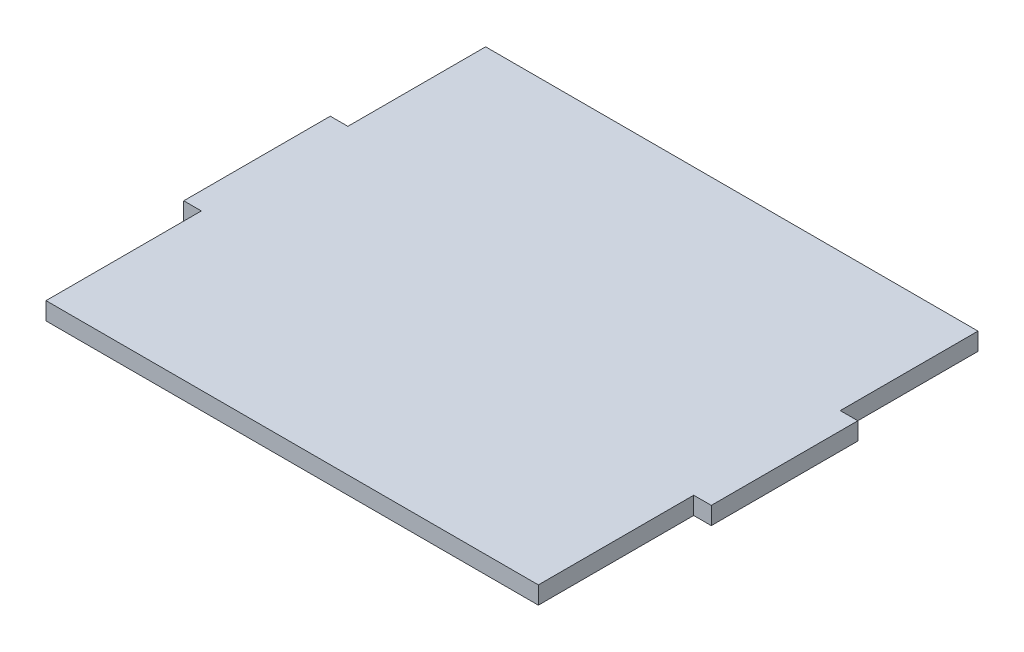
ISO-10303-21;
HEADER;
FILE_DESCRIPTION(('STEP AP214'),'2;1');
FILE_NAME('part.step','',(''),(''),'','','');
FILE_SCHEMA(('AUTOMOTIVE_DESIGN { 1 0 10303 214 1 1 1 1 }'));
ENDSEC;
DATA;
#1=APPLICATION_CONTEXT('core data for automotive mechanical design processes');
#2=APPLICATION_PROTOCOL_DEFINITION('international standard','automotive_design',2000,#1);
#3=PRODUCT_CONTEXT('',#1,'mechanical');
#4=PRODUCT('Part','Part','',(#3));
#5=PRODUCT_RELATED_PRODUCT_CATEGORY('part','',(#4));
#6=PRODUCT_DEFINITION_FORMATION('','',#4);
#7=PRODUCT_DEFINITION_CONTEXT('part definition',#1,'design');
#8=PRODUCT_DEFINITION('design','',#6,#7);
#9=PRODUCT_DEFINITION_SHAPE('','',#8);
#10=(LENGTH_UNIT() NAMED_UNIT(*) SI_UNIT(.MILLI.,.METRE.));
#11=(NAMED_UNIT(*) PLANE_ANGLE_UNIT() SI_UNIT($,.RADIAN.));
#12=(NAMED_UNIT(*) SI_UNIT($,.STERADIAN.) SOLID_ANGLE_UNIT());
#13=UNCERTAINTY_MEASURE_WITH_UNIT(LENGTH_MEASURE(1.E-05),#10,'distance_accuracy_value','');
#14=(GEOMETRIC_REPRESENTATION_CONTEXT(3) GLOBAL_UNCERTAINTY_ASSIGNED_CONTEXT((#13)) GLOBAL_UNIT_ASSIGNED_CONTEXT((#10,
#11,#12)) REPRESENTATION_CONTEXT('',''));
#15=CARTESIAN_POINT('',(0.,0.,0.));
#16=DIRECTION('',(0.,0.,1.));
#17=DIRECTION('',(1.,0.,0.));
#18=AXIS2_PLACEMENT_3D('',#15,#16,#17);
#19=CARTESIAN_POINT('',(0.,2.54,0.));
#20=DIRECTION('',(0.,0.,-1.));
#21=DIRECTION('',(-1.,0.,0.));
#22=AXIS2_PLACEMENT_3D('',#19,#20,#21);
#23=PLANE('',#22);
#24=DIRECTION('',(1.,0.,0.));
#25=VECTOR('',#24,1.);
#26=CARTESIAN_POINT('',(0.,2.54,0.));
#27=LINE('',#26,#25);
#28=CARTESIAN_POINT('',(2.54,2.54,0.));
#29=VERTEX_POINT('',#28);
#30=CARTESIAN_POINT('',(73.66,2.54,0.));
#31=VERTEX_POINT('',#30);
#32=EDGE_CURVE('E141',#29,#31,#27,.T.);
#33=ORIENTED_EDGE('',*,*,#32,.F.);
#34=DIRECTION('',(0.,1.,0.));
#35=VECTOR('',#34,1.);
#36=CARTESIAN_POINT('',(2.54,0.,0.));
#37=LINE('',#36,#35);
#38=CARTESIAN_POINT('',(2.54,0.,0.));
#39=VERTEX_POINT('',#38);
#40=EDGE_CURVE('E127',#39,#29,#37,.T.);
#41=ORIENTED_EDGE('',*,*,#40,.F.);
#42=DIRECTION('',(1.,0.,0.));
#43=VECTOR('',#42,1.);
#44=CARTESIAN_POINT('',(0.,0.,0.));
#45=LINE('',#44,#43);
#46=CARTESIAN_POINT('',(73.66,0.,0.));
#47=VERTEX_POINT('',#46);
#48=EDGE_CURVE('E139',#39,#47,#45,.T.);
#49=ORIENTED_EDGE('',*,*,#48,.T.);
#50=DIRECTION('',(0.,1.,0.));
#51=VECTOR('',#50,1.);
#52=CARTESIAN_POINT('',(73.66,0.,0.));
#53=LINE('',#52,#51);
#54=EDGE_CURVE('E227',#47,#31,#53,.T.);
#55=ORIENTED_EDGE('',*,*,#54,.T.);
#56=EDGE_LOOP('',(#33,#41,#49,#55));
#57=FACE_BOUND('',#56,.T.);
#58=ADVANCED_FACE('F37',(#57),#23,.F.);
#59=CARTESIAN_POINT('',(76.2,2.54,0.));
#60=DIRECTION('',(-1.,0.,0.));
#61=DIRECTION('',(0.,0.,1.));
#62=AXIS2_PLACEMENT_3D('',#59,#60,#61);
#63=PLANE('',#62);
#64=DIRECTION('',(0.,0.,-1.));
#65=VECTOR('',#64,1.);
#66=CARTESIAN_POINT('',(76.2,2.54,0.));
#67=LINE('',#66,#65);
#68=CARTESIAN_POINT('',(76.2,2.54,-22.4366582));
#69=VERTEX_POINT('',#68);
#70=CARTESIAN_POINT('',(76.2,2.54,-43.6033418));
#71=VERTEX_POINT('',#70);
#72=EDGE_CURVE('E164',#69,#71,#67,.T.);
#73=ORIENTED_EDGE('',*,*,#72,.F.);
#74=DIRECTION('',(0.,1.,0.));
#75=VECTOR('',#74,1.);
#76=CARTESIAN_POINT('',(76.2,0.,-22.4366582));
#77=LINE('',#76,#75);
#78=CARTESIAN_POINT('',(76.2,0.,-22.4366582));
#79=VERTEX_POINT('',#78);
#80=EDGE_CURVE('E191',#79,#69,#77,.T.);
#81=ORIENTED_EDGE('',*,*,#80,.F.);
#82=DIRECTION('',(0.,0.,-1.));
#83=VECTOR('',#82,1.);
#84=CARTESIAN_POINT('',(76.2,0.,0.));
#85=LINE('',#84,#83);
#86=CARTESIAN_POINT('',(76.2,0.,-43.6033418));
#87=VERTEX_POINT('',#86);
#88=EDGE_CURVE('E147',#79,#87,#85,.T.);
#89=ORIENTED_EDGE('',*,*,#88,.T.);
#90=DIRECTION('',(0.,1.,0.));
#91=VECTOR('',#90,1.);
#92=CARTESIAN_POINT('',(76.2,0.,-43.6033418));
#93=LINE('',#92,#91);
#94=EDGE_CURVE('E196',#87,#71,#93,.T.);
#95=ORIENTED_EDGE('',*,*,#94,.T.);
#96=EDGE_LOOP('',(#73,#81,#89,#95));
#97=FACE_BOUND('',#96,.T.);
#98=ADVANCED_FACE('F241',(#97),#63,.F.);
#99=CARTESIAN_POINT('',(0.,2.54,0.));
#100=DIRECTION('',(-1.,0.,0.));
#101=DIRECTION('',(0.,0.,1.));
#102=AXIS2_PLACEMENT_3D('',#99,#100,#101);
#103=PLANE('',#102);
#104=DIRECTION('',(0.,0.,-1.));
#105=VECTOR('',#104,1.);
#106=CARTESIAN_POINT('',(0.,0.,0.));
#107=LINE('',#106,#105);
#108=CARTESIAN_POINT('',(0.,0.,-22.4366582));
#109=VERTEX_POINT('',#108);
#110=CARTESIAN_POINT('',(0.,0.,-43.6033418));
#111=VERTEX_POINT('',#110);
#112=EDGE_CURVE('E40',#109,#111,#107,.T.);
#113=ORIENTED_EDGE('',*,*,#112,.F.);
#114=DIRECTION('',(0.,1.,0.));
#115=VECTOR('',#114,1.);
#116=CARTESIAN_POINT('',(0.,0.,-22.4366582));
#117=LINE('',#116,#115);
#118=CARTESIAN_POINT('',(0.,2.54,-22.4366582));
#119=VERTEX_POINT('',#118);
#120=EDGE_CURVE('E132',#109,#119,#117,.T.);
#121=ORIENTED_EDGE('',*,*,#120,.T.);
#122=DIRECTION('',(0.,0.,-1.));
#123=VECTOR('',#122,1.);
#124=CARTESIAN_POINT('',(0.,2.54,0.));
#125=LINE('',#124,#123);
#126=CARTESIAN_POINT('',(0.,2.54,-43.6033418));
#127=VERTEX_POINT('',#126);
#128=EDGE_CURVE('E11',#119,#127,#125,.T.);
#129=ORIENTED_EDGE('',*,*,#128,.T.);
#130=DIRECTION('',(0.,1.,0.));
#131=VECTOR('',#130,1.);
#132=CARTESIAN_POINT('',(0.,0.,-43.6033418));
#133=LINE('',#132,#131);
#134=EDGE_CURVE('E148',#111,#127,#133,.T.);
#135=ORIENTED_EDGE('',*,*,#134,.F.);
#136=EDGE_LOOP('',(#113,#121,#129,#135));
#137=FACE_BOUND('',#136,.T.);
#138=ADVANCED_FACE('F217',(#137),#103,.T.);
#139=CARTESIAN_POINT('',(0.,2.54,0.));
#140=DIRECTION('',(0.,1.,0.));
#141=DIRECTION('',(0.,0.,1.));
#142=AXIS2_PLACEMENT_3D('',#139,#140,#141);
#143=PLANE('',#142);
#144=ORIENTED_EDGE('',*,*,#128,.F.);
#145=DIRECTION('',(1.,0.,0.));
#146=VECTOR('',#145,1.);
#147=CARTESIAN_POINT('',(0.,2.54,-22.4366582));
#148=LINE('',#147,#146);
#149=CARTESIAN_POINT('',(2.54,2.54,-22.4366582));
#150=VERTEX_POINT('',#149);
#151=EDGE_CURVE('E214',#119,#150,#148,.T.);
#152=ORIENTED_EDGE('',*,*,#151,.T.);
#153=DIRECTION('',(0.,0.,-1.));
#154=VECTOR('',#153,1.);
#155=CARTESIAN_POINT('',(2.54,2.54,0.));
#156=LINE('',#155,#154);
#157=EDGE_CURVE('E221',#29,#150,#156,.T.);
#158=ORIENTED_EDGE('',*,*,#157,.F.);
#159=ORIENTED_EDGE('',*,*,#32,.T.);
#160=DIRECTION('',(0.,0.,-1.));
#161=VECTOR('',#160,1.);
#162=CARTESIAN_POINT('',(73.66,2.54,0.));
#163=LINE('',#162,#161);
#164=CARTESIAN_POINT('',(73.66,2.54,-22.4366582));
#165=VERTEX_POINT('',#164);
#166=EDGE_CURVE('E230',#31,#165,#163,.T.);
#167=ORIENTED_EDGE('',*,*,#166,.T.);
#168=DIRECTION('',(-1.,0.,0.));
#169=VECTOR('',#168,1.);
#170=CARTESIAN_POINT('',(76.2,2.54,-22.4366582));
#171=LINE('',#170,#169);
#172=EDGE_CURVE('E232',#69,#165,#171,.T.);
#173=ORIENTED_EDGE('',*,*,#172,.F.);
#174=ORIENTED_EDGE('',*,*,#72,.T.);
#175=DIRECTION('',(-1.,0.,0.));
#176=VECTOR('',#175,1.);
#177=CARTESIAN_POINT('',(76.2,2.54,-43.6033418));
#178=LINE('',#177,#176);
#179=CARTESIAN_POINT('',(73.66,2.54,-43.6033418));
#180=VERTEX_POINT('',#179);
#181=EDGE_CURVE('E188',#71,#180,#178,.T.);
#182=ORIENTED_EDGE('',*,*,#181,.T.);
#183=DIRECTION('',(0.,0.,1.));
#184=VECTOR('',#183,1.);
#185=CARTESIAN_POINT('',(73.66,2.54,-63.5));
#186=LINE('',#185,#184);
#187=CARTESIAN_POINT('',(73.66,2.54,-63.5));
#188=VERTEX_POINT('',#187);
#189=EDGE_CURVE('E187',#188,#180,#186,.T.);
#190=ORIENTED_EDGE('',*,*,#189,.F.);
#191=DIRECTION('',(1.,0.,0.));
#192=VECTOR('',#191,1.);
#193=CARTESIAN_POINT('',(0.,2.54,-63.5));
#194=LINE('',#193,#192);
#195=CARTESIAN_POINT('',(2.54,2.54,-63.5));
#196=VERTEX_POINT('',#195);
#197=EDGE_CURVE('E45',#196,#188,#194,.T.);
#198=ORIENTED_EDGE('',*,*,#197,.F.);
#199=DIRECTION('',(0.,0.,1.));
#200=VECTOR('',#199,1.);
#201=CARTESIAN_POINT('',(2.54,2.54,-63.5));
#202=LINE('',#201,#200);
#203=CARTESIAN_POINT('',(2.54,2.54,-43.6033418));
#204=VERTEX_POINT('',#203);
#205=EDGE_CURVE('E185',#196,#204,#202,.T.);
#206=ORIENTED_EDGE('',*,*,#205,.T.);
#207=DIRECTION('',(1.,0.,0.));
#208=VECTOR('',#207,1.);
#209=CARTESIAN_POINT('',(0.,2.54,-43.6033418));
#210=LINE('',#209,#208);
#211=EDGE_CURVE('E204',#127,#204,#210,.T.);
#212=ORIENTED_EDGE('',*,*,#211,.F.);
#213=EDGE_LOOP('',(#144,#152,#158,#159,#167,#173,#174,#182,#190,#198,#206,#212));
#214=FACE_BOUND('',#213,.T.);
#215=ADVANCED_FACE('F183',(#214),#143,.T.);
#216=CARTESIAN_POINT('',(0.,0.,0.));
#217=DIRECTION('',(0.,1.,0.));
#218=DIRECTION('',(0.,0.,1.));
#219=AXIS2_PLACEMENT_3D('',#216,#217,#218);
#220=PLANE('',#219);
#221=DIRECTION('',(1.,0.,0.));
#222=VECTOR('',#221,1.);
#223=CARTESIAN_POINT('',(0.,0.,-22.4366582));
#224=LINE('',#223,#222);
#225=CARTESIAN_POINT('',(2.54,0.,-22.4366582));
#226=VERTEX_POINT('',#225);
#227=EDGE_CURVE('E133',#109,#226,#224,.T.);
#228=ORIENTED_EDGE('',*,*,#227,.F.);
#229=ORIENTED_EDGE('',*,*,#112,.T.);
#230=DIRECTION('',(1.,0.,0.));
#231=VECTOR('',#230,1.);
#232=CARTESIAN_POINT('',(0.,0.,-43.6033418));
#233=LINE('',#232,#231);
#234=CARTESIAN_POINT('',(2.54,0.,-43.6033418));
#235=VERTEX_POINT('',#234);
#236=EDGE_CURVE('E200',#111,#235,#233,.T.);
#237=ORIENTED_EDGE('',*,*,#236,.T.);
#238=DIRECTION('',(0.,0.,1.));
#239=VECTOR('',#238,1.);
#240=CARTESIAN_POINT('',(2.54,0.,-63.5));
#241=LINE('',#240,#239);
#242=CARTESIAN_POINT('',(2.54,0.,-63.5));
#243=VERTEX_POINT('',#242);
#244=EDGE_CURVE('E202',#243,#235,#241,.T.);
#245=ORIENTED_EDGE('',*,*,#244,.F.);
#246=DIRECTION('',(1.,0.,0.));
#247=VECTOR('',#246,1.);
#248=CARTESIAN_POINT('',(0.,0.,-63.5));
#249=LINE('',#248,#247);
#250=CARTESIAN_POINT('',(73.66,0.,-63.5));
#251=VERTEX_POINT('',#250);
#252=EDGE_CURVE('E151',#243,#251,#249,.T.);
#253=ORIENTED_EDGE('',*,*,#252,.T.);
#254=DIRECTION('',(0.,0.,1.));
#255=VECTOR('',#254,1.);
#256=CARTESIAN_POINT('',(73.66,0.,-63.5));
#257=LINE('',#256,#255);
#258=CARTESIAN_POINT('',(73.66,0.,-43.6033418));
#259=VERTEX_POINT('',#258);
#260=EDGE_CURVE('E193',#251,#259,#257,.T.);
#261=ORIENTED_EDGE('',*,*,#260,.T.);
#262=DIRECTION('',(-1.,0.,0.));
#263=VECTOR('',#262,1.);
#264=CARTESIAN_POINT('',(76.2,0.,-43.6033418));
#265=LINE('',#264,#263);
#266=EDGE_CURVE('E189',#87,#259,#265,.T.);
#267=ORIENTED_EDGE('',*,*,#266,.F.);
#268=ORIENTED_EDGE('',*,*,#88,.F.);
#269=DIRECTION('',(-1.,0.,0.));
#270=VECTOR('',#269,1.);
#271=CARTESIAN_POINT('',(76.2,0.,-22.4366582));
#272=LINE('',#271,#270);
#273=CARTESIAN_POINT('',(73.66,0.,-22.4366582));
#274=VERTEX_POINT('',#273);
#275=EDGE_CURVE('E233',#79,#274,#272,.T.);
#276=ORIENTED_EDGE('',*,*,#275,.T.);
#277=DIRECTION('',(0.,0.,-1.));
#278=VECTOR('',#277,1.);
#279=CARTESIAN_POINT('',(73.66,0.,0.));
#280=LINE('',#279,#278);
#281=EDGE_CURVE('E146',#47,#274,#280,.T.);
#282=ORIENTED_EDGE('',*,*,#281,.F.);
#283=ORIENTED_EDGE('',*,*,#48,.F.);
#284=DIRECTION('',(0.,0.,-1.));
#285=VECTOR('',#284,1.);
#286=CARTESIAN_POINT('',(2.54,0.,0.));
#287=LINE('',#286,#285);
#288=EDGE_CURVE('E124',#39,#226,#287,.T.);
#289=ORIENTED_EDGE('',*,*,#288,.T.);
#290=EDGE_LOOP('',(#228,#229,#237,#245,#253,#261,#267,#268,#276,#282,#283,#289));
#291=FACE_BOUND('',#290,.T.);
#292=ADVANCED_FACE('F144',(#291),#220,.F.);
#293=CARTESIAN_POINT('',(0.,2.54,-63.5));
#294=DIRECTION('',(0.,0.,-1.));
#295=DIRECTION('',(-1.,0.,0.));
#296=AXIS2_PLACEMENT_3D('',#293,#294,#295);
#297=PLANE('',#296);
#298=DIRECTION('',(0.,1.,0.));
#299=VECTOR('',#298,1.);
#300=CARTESIAN_POINT('',(73.66,0.,-63.5));
#301=LINE('',#300,#299);
#302=EDGE_CURVE('E179',#251,#188,#301,.T.);
#303=ORIENTED_EDGE('',*,*,#302,.F.);
#304=ORIENTED_EDGE('',*,*,#252,.F.);
#305=DIRECTION('',(0.,1.,0.));
#306=VECTOR('',#305,1.);
#307=CARTESIAN_POINT('',(2.54,0.,-63.5));
#308=LINE('',#307,#306);
#309=EDGE_CURVE('E154',#243,#196,#308,.T.);
#310=ORIENTED_EDGE('',*,*,#309,.T.);
#311=ORIENTED_EDGE('',*,*,#197,.T.);
#312=EDGE_LOOP('',(#303,#304,#310,#311));
#313=FACE_BOUND('',#312,.T.);
#314=ADVANCED_FACE('F178',(#313),#297,.T.);
#315=CARTESIAN_POINT('',(0.,0.,-43.6033418));
#316=DIRECTION('',(0.,0.,1.));
#317=DIRECTION('',(1.,0.,0.));
#318=AXIS2_PLACEMENT_3D('',#315,#316,#317);
#319=PLANE('',#318);
#320=ORIENTED_EDGE('',*,*,#211,.T.);
#321=DIRECTION('',(0.,1.,0.));
#322=VECTOR('',#321,1.);
#323=CARTESIAN_POINT('',(2.54,0.,-43.6033418));
#324=LINE('',#323,#322);
#325=EDGE_CURVE('E171',#235,#204,#324,.T.);
#326=ORIENTED_EDGE('',*,*,#325,.F.);
#327=ORIENTED_EDGE('',*,*,#236,.F.);
#328=ORIENTED_EDGE('',*,*,#134,.T.);
#329=EDGE_LOOP('',(#320,#326,#327,#328));
#330=FACE_BOUND('',#329,.T.);
#331=ADVANCED_FACE('F211',(#330),#319,.F.);
#332=CARTESIAN_POINT('',(2.54,0.,-63.5));
#333=DIRECTION('',(-1.,0.,0.));
#334=DIRECTION('',(0.,0.,1.));
#335=AXIS2_PLACEMENT_3D('',#332,#333,#334);
#336=PLANE('',#335);
#337=ORIENTED_EDGE('',*,*,#205,.F.);
#338=ORIENTED_EDGE('',*,*,#309,.F.);
#339=ORIENTED_EDGE('',*,*,#244,.T.);
#340=ORIENTED_EDGE('',*,*,#325,.T.);
#341=EDGE_LOOP('',(#337,#338,#339,#340));
#342=FACE_BOUND('',#341,.T.);
#343=ADVANCED_FACE('F209',(#342),#336,.T.);
#344=CARTESIAN_POINT('',(76.2,0.,-43.6033418));
#345=DIRECTION('',(0.,0.,-1.));
#346=DIRECTION('',(-1.,0.,0.));
#347=AXIS2_PLACEMENT_3D('',#344,#345,#346);
#348=PLANE('',#347);
#349=ORIENTED_EDGE('',*,*,#181,.F.);
#350=ORIENTED_EDGE('',*,*,#94,.F.);
#351=ORIENTED_EDGE('',*,*,#266,.T.);
#352=DIRECTION('',(0.,1.,0.));
#353=VECTOR('',#352,1.);
#354=CARTESIAN_POINT('',(73.66,0.,-43.6033418));
#355=LINE('',#354,#353);
#356=EDGE_CURVE('E61',#259,#180,#355,.T.);
#357=ORIENTED_EDGE('',*,*,#356,.T.);
#358=EDGE_LOOP('',(#349,#350,#351,#357));
#359=FACE_BOUND('',#358,.T.);
#360=ADVANCED_FACE('F250',(#359),#348,.T.);
#361=CARTESIAN_POINT('',(73.66,0.,-63.5));
#362=DIRECTION('',(-1.,0.,0.));
#363=DIRECTION('',(0.,0.,1.));
#364=AXIS2_PLACEMENT_3D('',#361,#362,#363);
#365=PLANE('',#364);
#366=ORIENTED_EDGE('',*,*,#189,.T.);
#367=ORIENTED_EDGE('',*,*,#356,.F.);
#368=ORIENTED_EDGE('',*,*,#260,.F.);
#369=ORIENTED_EDGE('',*,*,#302,.T.);
#370=EDGE_LOOP('',(#366,#367,#368,#369));
#371=FACE_BOUND('',#370,.T.);
#372=ADVANCED_FACE('F252',(#371),#365,.F.);
#373=CARTESIAN_POINT('',(76.2,0.,-22.4366582));
#374=DIRECTION('',(0.,0.,-1.));
#375=DIRECTION('',(-1.,0.,0.));
#376=AXIS2_PLACEMENT_3D('',#373,#374,#375);
#377=PLANE('',#376);
#378=ORIENTED_EDGE('',*,*,#172,.T.);
#379=DIRECTION('',(0.,1.,0.));
#380=VECTOR('',#379,1.);
#381=CARTESIAN_POINT('',(73.66,0.,-22.4366582));
#382=LINE('',#381,#380);
#383=EDGE_CURVE('E225',#274,#165,#382,.T.);
#384=ORIENTED_EDGE('',*,*,#383,.F.);
#385=ORIENTED_EDGE('',*,*,#275,.F.);
#386=ORIENTED_EDGE('',*,*,#80,.T.);
#387=EDGE_LOOP('',(#378,#384,#385,#386));
#388=FACE_BOUND('',#387,.T.);
#389=ADVANCED_FACE('F249',(#388),#377,.F.);
#390=CARTESIAN_POINT('',(73.66,0.,0.));
#391=DIRECTION('',(1.,0.,0.));
#392=DIRECTION('',(0.,0.,-1.));
#393=AXIS2_PLACEMENT_3D('',#390,#391,#392);
#394=PLANE('',#393);
#395=ORIENTED_EDGE('',*,*,#166,.F.);
#396=ORIENTED_EDGE('',*,*,#54,.F.);
#397=ORIENTED_EDGE('',*,*,#281,.T.);
#398=ORIENTED_EDGE('',*,*,#383,.T.);
#399=EDGE_LOOP('',(#395,#396,#397,#398));
#400=FACE_BOUND('',#399,.T.);
#401=ADVANCED_FACE('F340',(#400),#394,.T.);
#402=CARTESIAN_POINT('',(0.,0.,-22.4366582));
#403=DIRECTION('',(0.,0.,1.));
#404=DIRECTION('',(1.,0.,0.));
#405=AXIS2_PLACEMENT_3D('',#402,#403,#404);
#406=PLANE('',#405);
#407=ORIENTED_EDGE('',*,*,#151,.F.);
#408=ORIENTED_EDGE('',*,*,#120,.F.);
#409=ORIENTED_EDGE('',*,*,#227,.T.);
#410=DIRECTION('',(0.,1.,0.));
#411=VECTOR('',#410,1.);
#412=CARTESIAN_POINT('',(2.54,0.,-22.4366582));
#413=LINE('',#412,#411);
#414=EDGE_CURVE('E53',#226,#150,#413,.T.);
#415=ORIENTED_EDGE('',*,*,#414,.T.);
#416=EDGE_LOOP('',(#407,#408,#409,#415));
#417=FACE_BOUND('',#416,.T.);
#418=ADVANCED_FACE('F350',(#417),#406,.T.);
#419=CARTESIAN_POINT('',(2.54,0.,0.));
#420=DIRECTION('',(1.,0.,0.));
#421=DIRECTION('',(0.,0.,-1.));
#422=AXIS2_PLACEMENT_3D('',#419,#420,#421);
#423=PLANE('',#422);
#424=ORIENTED_EDGE('',*,*,#157,.T.);
#425=ORIENTED_EDGE('',*,*,#414,.F.);
#426=ORIENTED_EDGE('',*,*,#288,.F.);
#427=ORIENTED_EDGE('',*,*,#40,.T.);
#428=EDGE_LOOP('',(#424,#425,#426,#427));
#429=FACE_BOUND('',#428,.T.);
#430=ADVANCED_FACE('F126',(#429),#423,.F.);
#431=CLOSED_SHELL('',(#58,#98,#138,#215,#292,#314,#331,#343,#360,#372,#389,#401,#418,#430));
#432=MANIFOLD_SOLID_BREP('B2',#431);
#433=ADVANCED_BREP_SHAPE_REPRESENTATION('',(#18,#432),#14);
#434=SHAPE_DEFINITION_REPRESENTATION(#9,#433);
ENDSEC;
END-ISO-10303-21;
